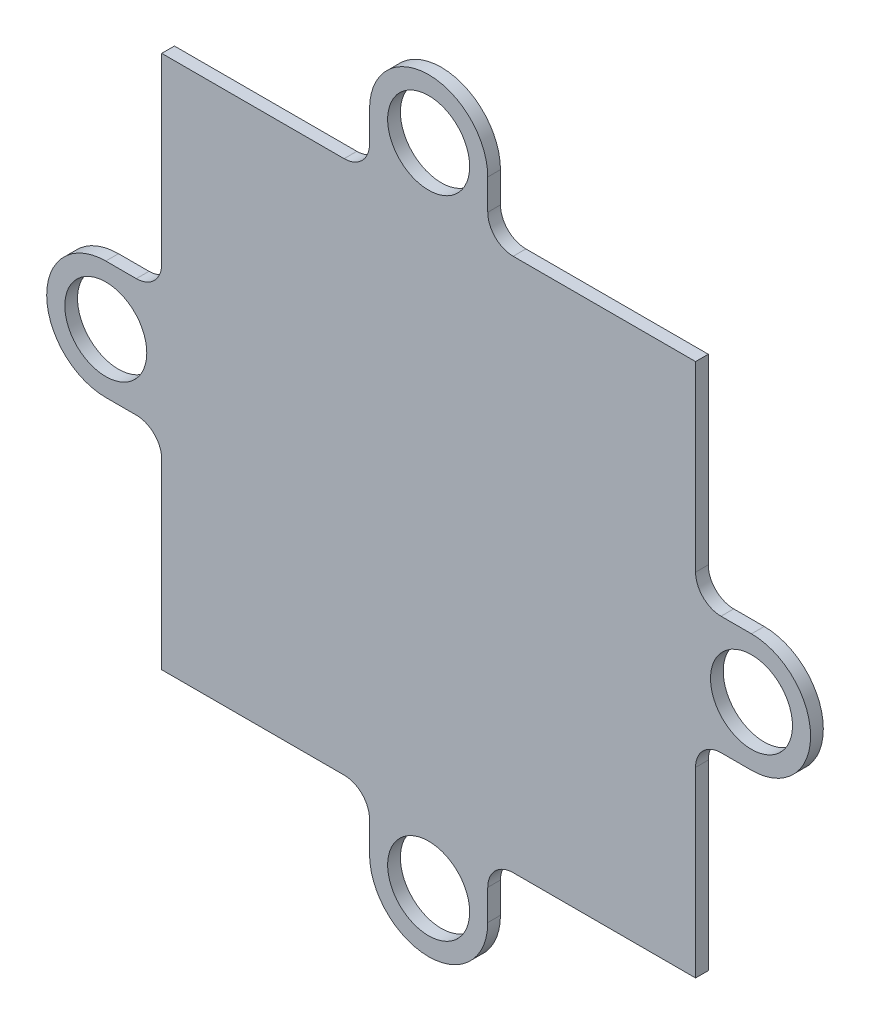
ISO-10303-21;
HEADER;
FILE_DESCRIPTION(('STEP AP214'),'2;1');
FILE_NAME('part.step','',(''),(''),'','','');
FILE_SCHEMA(('AUTOMOTIVE_DESIGN { 1 0 10303 214 1 1 1 1 }'));
ENDSEC;
DATA;
#1=APPLICATION_CONTEXT('core data for automotive mechanical design processes');
#2=APPLICATION_PROTOCOL_DEFINITION('international standard','automotive_design',2000,#1);
#3=PRODUCT_CONTEXT('',#1,'mechanical');
#4=PRODUCT('Part','Part','',(#3));
#5=PRODUCT_RELATED_PRODUCT_CATEGORY('part','',(#4));
#6=PRODUCT_DEFINITION_FORMATION('','',#4);
#7=PRODUCT_DEFINITION_CONTEXT('part definition',#1,'design');
#8=PRODUCT_DEFINITION('design','',#6,#7);
#9=PRODUCT_DEFINITION_SHAPE('','',#8);
#10=(LENGTH_UNIT() NAMED_UNIT(*) SI_UNIT(.MILLI.,.METRE.));
#11=(NAMED_UNIT(*) PLANE_ANGLE_UNIT() SI_UNIT($,.RADIAN.));
#12=(NAMED_UNIT(*) SI_UNIT($,.STERADIAN.) SOLID_ANGLE_UNIT());
#13=UNCERTAINTY_MEASURE_WITH_UNIT(LENGTH_MEASURE(1.E-05),#10,'distance_accuracy_value','');
#14=(GEOMETRIC_REPRESENTATION_CONTEXT(3) GLOBAL_UNCERTAINTY_ASSIGNED_CONTEXT((#13)) GLOBAL_UNIT_ASSIGNED_CONTEXT((#10,
#11,#12)) REPRESENTATION_CONTEXT('',''));
#15=CARTESIAN_POINT('',(0.,0.,0.));
#16=DIRECTION('',(0.,0.,1.));
#17=DIRECTION('',(1.,0.,0.));
#18=AXIS2_PLACEMENT_3D('',#15,#16,#17);
#19=CARTESIAN_POINT('',(0.,-4.64999999999974,1.));
#20=DIRECTION('',(0.,1.,0.));
#21=DIRECTION('',(0.,0.,1.));
#22=AXIS2_PLACEMENT_3D('',#19,#20,#21);
#23=PLANE('',#22);
#24=DIRECTION('',(1.,0.,0.));
#25=VECTOR('',#24,1.);
#26=CARTESIAN_POINT('',(0.,-4.64999999999974,0.));
#27=LINE('',#26,#25);
#28=CARTESIAN_POINT('',(-25.4000000000001,-4.64999999999974,0.));
#29=VERTEX_POINT('',#28);
#30=CARTESIAN_POINT('',(-23.0000000000001,-4.64999999999974,0.));
#31=VERTEX_POINT('',#30);
#32=EDGE_CURVE('E282',#29,#31,#27,.T.);
#33=ORIENTED_EDGE('',*,*,#32,.T.);
#34=DIRECTION('',(0.,0.,-1.));
#35=VECTOR('',#34,1.);
#36=CARTESIAN_POINT('',(-23.0000000000001,-4.64999999999974,1.));
#37=LINE('',#36,#35);
#38=CARTESIAN_POINT('',(-23.0000000000001,-4.64999999999974,1.));
#39=VERTEX_POINT('',#38);
#40=EDGE_CURVE('E11',#39,#31,#37,.T.);
#41=ORIENTED_EDGE('',*,*,#40,.F.);
#42=DIRECTION('',(1.,0.,0.));
#43=VECTOR('',#42,1.);
#44=CARTESIAN_POINT('',(0.,-4.64999999999974,1.));
#45=LINE('',#44,#43);
#46=CARTESIAN_POINT('',(-25.4000000000001,-4.64999999999974,1.));
#47=VERTEX_POINT('',#46);
#48=EDGE_CURVE('E488',#47,#39,#45,.T.);
#49=ORIENTED_EDGE('',*,*,#48,.F.);
#50=DIRECTION('',(0.,0.,-1.));
#51=VECTOR('',#50,1.);
#52=CARTESIAN_POINT('',(-25.4000000000001,-4.64999999999974,1.));
#53=LINE('',#52,#51);
#54=EDGE_CURVE('E262',#47,#29,#53,.T.);
#55=ORIENTED_EDGE('',*,*,#54,.T.);
#56=EDGE_LOOP('',(#33,#41,#49,#55));
#57=FACE_BOUND('',#56,.T.);
#58=ADVANCED_FACE('F45',(#57),#23,.F.);
#59=CARTESIAN_POINT('',(-23.0000000000001,-6.64999999999976,1.));
#60=DIRECTION('',(0.,0.,-1.));
#61=DIRECTION('',(-1.,0.,0.));
#62=AXIS2_PLACEMENT_3D('',#59,#60,#61);
#63=CYLINDRICAL_SURFACE('',#62,2.00000000000001);
#64=CARTESIAN_POINT('',(-23.0000000000001,-6.64999999999976,0.));
#65=DIRECTION('',(0.,0.,1.));
#66=DIRECTION('',(1.,0.,0.));
#67=AXIS2_PLACEMENT_3D('',#64,#65,#66);
#68=CIRCLE('',#67,2.00000000000001);
#69=CARTESIAN_POINT('',(-21.0000000000001,-6.6499999999998,0.));
#70=VERTEX_POINT('',#69);
#71=EDGE_CURVE('E286',#31,#70,#68,.F.);
#72=ORIENTED_EDGE('',*,*,#71,.T.);
#73=DIRECTION('',(0.,0.,-1.));
#74=VECTOR('',#73,1.);
#75=CARTESIAN_POINT('',(-21.0000000000001,-6.6499999999998,1.));
#76=LINE('',#75,#74);
#77=CARTESIAN_POINT('',(-21.0000000000001,-6.6499999999998,1.));
#78=VERTEX_POINT('',#77);
#79=EDGE_CURVE('E55',#78,#70,#76,.T.);
#80=ORIENTED_EDGE('',*,*,#79,.F.);
#81=CARTESIAN_POINT('',(-23.0000000000001,-6.64999999999976,1.));
#82=DIRECTION('',(0.,0.,1.));
#83=DIRECTION('',(1.,0.,0.));
#84=AXIS2_PLACEMENT_3D('',#81,#82,#83);
#85=CIRCLE('',#84,2.00000000000001);
#86=EDGE_CURVE('E162',#39,#78,#85,.F.);
#87=ORIENTED_EDGE('',*,*,#86,.F.);
#88=ORIENTED_EDGE('',*,*,#40,.T.);
#89=EDGE_LOOP('',(#72,#80,#87,#88));
#90=FACE_BOUND('',#89,.T.);
#91=ADVANCED_FACE('F468',(#90),#63,.F.);
#92=CARTESIAN_POINT('',(-21.0000000000001,-1.01544788837666E-13,1.));
#93=DIRECTION('',(-1.,0.,0.));
#94=DIRECTION('',(0.,-1.,0.));
#95=AXIS2_PLACEMENT_3D('',#92,#93,#94);
#96=PLANE('',#95);
#97=DIRECTION('',(0.,1.,0.));
#98=VECTOR('',#97,1.);
#99=CARTESIAN_POINT('',(-21.0000000000001,-1.01544788837666E-13,0.));
#100=LINE('',#99,#98);
#101=CARTESIAN_POINT('',(-21.,-21.,0.));
#102=VERTEX_POINT('',#101);
#103=EDGE_CURVE('E290',#102,#70,#100,.T.);
#104=ORIENTED_EDGE('',*,*,#103,.F.);
#105=DIRECTION('',(0.,0.,-1.));
#106=VECTOR('',#105,1.);
#107=CARTESIAN_POINT('',(-21.,-21.,1.));
#108=LINE('',#107,#106);
#109=CARTESIAN_POINT('',(-21.,-21.,1.));
#110=VERTEX_POINT('',#109);
#111=EDGE_CURVE('E459',#110,#102,#108,.T.);
#112=ORIENTED_EDGE('',*,*,#111,.F.);
#113=DIRECTION('',(0.,1.,0.));
#114=VECTOR('',#113,1.);
#115=CARTESIAN_POINT('',(-21.0000000000001,-1.01544788837666E-13,1.));
#116=LINE('',#115,#114);
#117=EDGE_CURVE('E467',#110,#78,#116,.T.);
#118=ORIENTED_EDGE('',*,*,#117,.T.);
#119=ORIENTED_EDGE('',*,*,#79,.T.);
#120=EDGE_LOOP('',(#104,#112,#118,#119));
#121=FACE_BOUND('',#120,.T.);
#122=ADVANCED_FACE('F465',(#121),#96,.T.);
#123=CARTESIAN_POINT('',(1.827806199078E-13,-20.9999999999998,1.));
#124=DIRECTION('',(0.,1.,0.));
#125=DIRECTION('',(-1.,0.,0.));
#126=AXIS2_PLACEMENT_3D('',#123,#124,#125);
#127=PLANE('',#126);
#128=DIRECTION('',(1.,0.,0.));
#129=VECTOR('',#128,1.);
#130=CARTESIAN_POINT('',(1.827806199078E-13,-20.9999999999998,0.));
#131=LINE('',#130,#129);
#132=CARTESIAN_POINT('',(-6.65000000000012,-20.9999999999999,0.));
#133=VERTEX_POINT('',#132);
#134=EDGE_CURVE('E294',#102,#133,#131,.T.);
#135=ORIENTED_EDGE('',*,*,#134,.T.);
#136=DIRECTION('',(0.,0.,-1.));
#137=VECTOR('',#136,1.);
#138=CARTESIAN_POINT('',(-6.65000000000012,-20.9999999999999,1.));
#139=LINE('',#138,#137);
#140=CARTESIAN_POINT('',(-6.65000000000012,-20.9999999999999,1.));
#141=VERTEX_POINT('',#140);
#142=EDGE_CURVE('E456',#141,#133,#139,.T.);
#143=ORIENTED_EDGE('',*,*,#142,.F.);
#144=DIRECTION('',(1.,0.,0.));
#145=VECTOR('',#144,1.);
#146=CARTESIAN_POINT('',(1.827806199078E-13,-20.9999999999998,1.));
#147=LINE('',#146,#145);
#148=EDGE_CURVE('E480',#110,#141,#147,.T.);
#149=ORIENTED_EDGE('',*,*,#148,.F.);
#150=ORIENTED_EDGE('',*,*,#111,.T.);
#151=EDGE_LOOP('',(#135,#143,#149,#150));
#152=FACE_BOUND('',#151,.T.);
#153=ADVANCED_FACE('F477',(#152),#127,.F.);
#154=CARTESIAN_POINT('',(-6.65000000000008,-22.9999999999999,1.));
#155=DIRECTION('',(0.,0.,-1.));
#156=DIRECTION('',(-1.,0.,0.));
#157=AXIS2_PLACEMENT_3D('',#154,#155,#156);
#158=CYLINDRICAL_SURFACE('',#157,2.);
#159=CARTESIAN_POINT('',(-6.65000000000008,-22.9999999999999,0.));
#160=DIRECTION('',(0.,0.,1.));
#161=DIRECTION('',(1.,0.,0.));
#162=AXIS2_PLACEMENT_3D('',#159,#160,#161);
#163=CIRCLE('',#162,2.);
#164=CARTESIAN_POINT('',(-4.65000000000009,-22.9999999999999,0.));
#165=VERTEX_POINT('',#164);
#166=EDGE_CURVE('E298',#165,#133,#163,.T.);
#167=ORIENTED_EDGE('',*,*,#166,.F.);
#168=DIRECTION('',(0.,0.,-1.));
#169=VECTOR('',#168,1.);
#170=CARTESIAN_POINT('',(-4.65000000000009,-22.9999999999999,1.));
#171=LINE('',#170,#169);
#172=CARTESIAN_POINT('',(-4.65000000000009,-22.9999999999999,1.));
#173=VERTEX_POINT('',#172);
#174=EDGE_CURVE('E453',#173,#165,#171,.T.);
#175=ORIENTED_EDGE('',*,*,#174,.F.);
#176=CARTESIAN_POINT('',(-6.65000000000008,-22.9999999999999,1.));
#177=DIRECTION('',(0.,0.,1.));
#178=DIRECTION('',(1.,0.,0.));
#179=AXIS2_PLACEMENT_3D('',#176,#177,#178);
#180=CIRCLE('',#179,2.);
#181=EDGE_CURVE('E483',#173,#141,#180,.T.);
#182=ORIENTED_EDGE('',*,*,#181,.T.);
#183=ORIENTED_EDGE('',*,*,#142,.T.);
#184=EDGE_LOOP('',(#167,#175,#182,#183));
#185=FACE_BOUND('',#184,.T.);
#186=ADVANCED_FACE('F841',(#185),#158,.F.);
#187=CARTESIAN_POINT('',(-4.65000000000009,0.,1.));
#188=DIRECTION('',(-1.,0.,0.));
#189=DIRECTION('',(0.,0.,1.));
#190=AXIS2_PLACEMENT_3D('',#187,#188,#189);
#191=PLANE('',#190);
#192=DIRECTION('',(0.,1.,0.));
#193=VECTOR('',#192,1.);
#194=CARTESIAN_POINT('',(-4.65000000000009,0.,0.));
#195=LINE('',#194,#193);
#196=CARTESIAN_POINT('',(-4.65000000000009,-25.4,0.));
#197=VERTEX_POINT('',#196);
#198=EDGE_CURVE('E302',#197,#165,#195,.T.);
#199=ORIENTED_EDGE('',*,*,#198,.F.);
#200=DIRECTION('',(0.,0.,-1.));
#201=VECTOR('',#200,1.);
#202=CARTESIAN_POINT('',(-4.65000000000009,-25.4,1.));
#203=LINE('',#202,#201);
#204=CARTESIAN_POINT('',(-4.65000000000009,-25.4,1.));
#205=VERTEX_POINT('',#204);
#206=EDGE_CURVE('E450',#205,#197,#203,.T.);
#207=ORIENTED_EDGE('',*,*,#206,.F.);
#208=DIRECTION('',(0.,1.,0.));
#209=VECTOR('',#208,1.);
#210=CARTESIAN_POINT('',(-4.65000000000009,0.,1.));
#211=LINE('',#210,#209);
#212=EDGE_CURVE('E494',#205,#173,#211,.T.);
#213=ORIENTED_EDGE('',*,*,#212,.T.);
#214=ORIENTED_EDGE('',*,*,#174,.T.);
#215=EDGE_LOOP('',(#199,#207,#213,#214));
#216=FACE_BOUND('',#215,.T.);
#217=ADVANCED_FACE('F832',(#216),#191,.T.);
#218=CARTESIAN_POINT('',(0.,-25.4,1.));
#219=DIRECTION('',(0.,0.,-1.));
#220=DIRECTION('',(-1.,0.,0.));
#221=AXIS2_PLACEMENT_3D('',#218,#219,#220);
#222=CYLINDRICAL_SURFACE('',#221,4.65);
#223=CARTESIAN_POINT('',(0.,-25.4,0.));
#224=DIRECTION('',(0.,0.,1.));
#225=DIRECTION('',(1.,0.,0.));
#226=AXIS2_PLACEMENT_3D('',#223,#224,#225);
#227=CIRCLE('',#226,4.65);
#228=CARTESIAN_POINT('',(4.64999999999991,-25.4,0.));
#229=VERTEX_POINT('',#228);
#230=EDGE_CURVE('E306',#197,#229,#227,.T.);
#231=ORIENTED_EDGE('',*,*,#230,.T.);
#232=DIRECTION('',(0.,0.,-1.));
#233=VECTOR('',#232,1.);
#234=CARTESIAN_POINT('',(4.64999999999991,-25.4,1.));
#235=LINE('',#234,#233);
#236=CARTESIAN_POINT('',(4.64999999999991,-25.4,1.));
#237=VERTEX_POINT('',#236);
#238=EDGE_CURVE('E446',#237,#229,#235,.T.);
#239=ORIENTED_EDGE('',*,*,#238,.F.);
#240=CARTESIAN_POINT('',(0.,-25.4,1.));
#241=DIRECTION('',(0.,0.,1.));
#242=DIRECTION('',(1.,0.,0.));
#243=AXIS2_PLACEMENT_3D('',#240,#241,#242);
#244=CIRCLE('',#243,4.65);
#245=EDGE_CURVE('E498',#205,#237,#244,.T.);
#246=ORIENTED_EDGE('',*,*,#245,.F.);
#247=ORIENTED_EDGE('',*,*,#206,.T.);
#248=EDGE_LOOP('',(#231,#239,#246,#247));
#249=FACE_BOUND('',#248,.T.);
#250=ADVANCED_FACE('F823',(#249),#222,.T.);
#251=CARTESIAN_POINT('',(4.64999999999991,0.,1.));
#252=DIRECTION('',(-1.,0.,0.));
#253=DIRECTION('',(0.,0.,1.));
#254=AXIS2_PLACEMENT_3D('',#251,#252,#253);
#255=PLANE('',#254);
#256=DIRECTION('',(0.,1.,0.));
#257=VECTOR('',#256,1.);
#258=CARTESIAN_POINT('',(4.64999999999991,0.,0.));
#259=LINE('',#258,#257);
#260=CARTESIAN_POINT('',(4.64999999999991,-22.9999999999999,0.));
#261=VERTEX_POINT('',#260);
#262=EDGE_CURVE('E309',#229,#261,#259,.T.);
#263=ORIENTED_EDGE('',*,*,#262,.T.);
#264=DIRECTION('',(0.,0.,-1.));
#265=VECTOR('',#264,1.);
#266=CARTESIAN_POINT('',(4.64999999999991,-22.9999999999999,1.));
#267=LINE('',#266,#265);
#268=CARTESIAN_POINT('',(4.64999999999991,-22.9999999999999,1.));
#269=VERTEX_POINT('',#268);
#270=EDGE_CURVE('E442',#269,#261,#267,.T.);
#271=ORIENTED_EDGE('',*,*,#270,.F.);
#272=DIRECTION('',(0.,1.,0.));
#273=VECTOR('',#272,1.);
#274=CARTESIAN_POINT('',(4.64999999999991,0.,1.));
#275=LINE('',#274,#273);
#276=EDGE_CURVE('E501',#237,#269,#275,.T.);
#277=ORIENTED_EDGE('',*,*,#276,.F.);
#278=ORIENTED_EDGE('',*,*,#238,.T.);
#279=EDGE_LOOP('',(#263,#271,#277,#278));
#280=FACE_BOUND('',#279,.T.);
#281=ADVANCED_FACE('F814',(#280),#255,.F.);
#282=CARTESIAN_POINT('',(6.6499999999999,-22.9999999999999,1.));
#283=DIRECTION('',(0.,0.,-1.));
#284=DIRECTION('',(-1.,0.,0.));
#285=AXIS2_PLACEMENT_3D('',#282,#283,#284);
#286=CYLINDRICAL_SURFACE('',#285,2.);
#287=CARTESIAN_POINT('',(6.6499999999999,-22.9999999999999,0.));
#288=DIRECTION('',(0.,0.,1.));
#289=DIRECTION('',(1.,0.,0.));
#290=AXIS2_PLACEMENT_3D('',#287,#288,#289);
#291=CIRCLE('',#290,2.);
#292=CARTESIAN_POINT('',(6.64999999999994,-20.9999999999999,0.));
#293=VERTEX_POINT('',#292);
#294=EDGE_CURVE('E312',#261,#293,#291,.F.);
#295=ORIENTED_EDGE('',*,*,#294,.T.);
#296=DIRECTION('',(0.,0.,-1.));
#297=VECTOR('',#296,1.);
#298=CARTESIAN_POINT('',(6.64999999999994,-20.9999999999999,1.));
#299=LINE('',#298,#297);
#300=CARTESIAN_POINT('',(6.64999999999994,-20.9999999999999,1.));
#301=VERTEX_POINT('',#300);
#302=EDGE_CURVE('E438',#301,#293,#299,.T.);
#303=ORIENTED_EDGE('',*,*,#302,.F.);
#304=CARTESIAN_POINT('',(6.6499999999999,-22.9999999999999,1.));
#305=DIRECTION('',(0.,0.,1.));
#306=DIRECTION('',(1.,0.,0.));
#307=AXIS2_PLACEMENT_3D('',#304,#305,#306);
#308=CIRCLE('',#307,2.);
#309=EDGE_CURVE('E504',#269,#301,#308,.F.);
#310=ORIENTED_EDGE('',*,*,#309,.F.);
#311=ORIENTED_EDGE('',*,*,#270,.T.);
#312=EDGE_LOOP('',(#295,#303,#310,#311));
#313=FACE_BOUND('',#312,.T.);
#314=ADVANCED_FACE('F805',(#313),#286,.F.);
#315=CARTESIAN_POINT('',(0.,-20.9999999999999,1.));
#316=DIRECTION('',(0.,1.,0.));
#317=DIRECTION('',(0.,0.,1.));
#318=AXIS2_PLACEMENT_3D('',#315,#316,#317);
#319=PLANE('',#318);
#320=DIRECTION('',(1.,0.,0.));
#321=VECTOR('',#320,1.);
#322=CARTESIAN_POINT('',(0.,-20.9999999999999,0.));
#323=LINE('',#322,#321);
#324=CARTESIAN_POINT('',(21.,-21.,0.));
#325=VERTEX_POINT('',#324);
#326=EDGE_CURVE('E315',#293,#325,#323,.T.);
#327=ORIENTED_EDGE('',*,*,#326,.T.);
#328=DIRECTION('',(0.,0.,-1.));
#329=VECTOR('',#328,1.);
#330=CARTESIAN_POINT('',(21.,-21.,1.));
#331=LINE('',#330,#329);
#332=CARTESIAN_POINT('',(21.,-21.,1.));
#333=VERTEX_POINT('',#332);
#334=EDGE_CURVE('E434',#333,#325,#331,.T.);
#335=ORIENTED_EDGE('',*,*,#334,.F.);
#336=DIRECTION('',(1.,0.,0.));
#337=VECTOR('',#336,1.);
#338=CARTESIAN_POINT('',(0.,-20.9999999999999,1.));
#339=LINE('',#338,#337);
#340=EDGE_CURVE('E507',#301,#333,#339,.T.);
#341=ORIENTED_EDGE('',*,*,#340,.F.);
#342=ORIENTED_EDGE('',*,*,#302,.T.);
#343=EDGE_LOOP('',(#327,#335,#341,#342));
#344=FACE_BOUND('',#343,.T.);
#345=ADVANCED_FACE('F796',(#344),#319,.F.);
#346=CARTESIAN_POINT('',(21.,0.,1.));
#347=DIRECTION('',(-1.,0.,0.));
#348=DIRECTION('',(0.,-1.,0.));
#349=AXIS2_PLACEMENT_3D('',#346,#347,#348);
#350=PLANE('',#349);
#351=DIRECTION('',(0.,1.,0.));
#352=VECTOR('',#351,1.);
#353=CARTESIAN_POINT('',(21.,0.,0.));
#354=LINE('',#353,#352);
#355=CARTESIAN_POINT('',(21.,-6.6500000000001,0.));
#356=VERTEX_POINT('',#355);
#357=EDGE_CURVE('E318',#325,#356,#354,.T.);
#358=ORIENTED_EDGE('',*,*,#357,.T.);
#359=DIRECTION('',(0.,0.,-1.));
#360=VECTOR('',#359,1.);
#361=CARTESIAN_POINT('',(21.,-6.6500000000001,1.));
#362=LINE('',#361,#360);
#363=CARTESIAN_POINT('',(21.,-6.6500000000001,1.));
#364=VERTEX_POINT('',#363);
#365=EDGE_CURVE('E431',#364,#356,#362,.T.);
#366=ORIENTED_EDGE('',*,*,#365,.F.);
#367=DIRECTION('',(0.,1.,0.));
#368=VECTOR('',#367,1.);
#369=CARTESIAN_POINT('',(21.,0.,1.));
#370=LINE('',#369,#368);
#371=EDGE_CURVE('E510',#333,#364,#370,.T.);
#372=ORIENTED_EDGE('',*,*,#371,.F.);
#373=ORIENTED_EDGE('',*,*,#334,.T.);
#374=EDGE_LOOP('',(#358,#366,#372,#373));
#375=FACE_BOUND('',#374,.T.);
#376=ADVANCED_FACE('F787',(#375),#350,.F.);
#377=CARTESIAN_POINT('',(23.,-6.65000000000009,1.));
#378=DIRECTION('',(0.,0.,-1.));
#379=DIRECTION('',(-1.,0.,0.));
#380=AXIS2_PLACEMENT_3D('',#377,#378,#379);
#381=CYLINDRICAL_SURFACE('',#380,2.);
#382=CARTESIAN_POINT('',(23.,-6.65000000000009,0.));
#383=DIRECTION('',(0.,0.,1.));
#384=DIRECTION('',(1.,0.,0.));
#385=AXIS2_PLACEMENT_3D('',#382,#383,#384);
#386=CIRCLE('',#385,2.);
#387=CARTESIAN_POINT('',(23.,-4.6500000000001,0.));
#388=VERTEX_POINT('',#387);
#389=EDGE_CURVE('E322',#388,#356,#386,.T.);
#390=ORIENTED_EDGE('',*,*,#389,.F.);
#391=DIRECTION('',(0.,0.,-1.));
#392=VECTOR('',#391,1.);
#393=CARTESIAN_POINT('',(23.,-4.6500000000001,1.));
#394=LINE('',#393,#392);
#395=CARTESIAN_POINT('',(23.,-4.6500000000001,1.));
#396=VERTEX_POINT('',#395);
#397=EDGE_CURVE('E428',#396,#388,#394,.T.);
#398=ORIENTED_EDGE('',*,*,#397,.F.);
#399=CARTESIAN_POINT('',(23.,-6.65000000000009,1.));
#400=DIRECTION('',(0.,0.,1.));
#401=DIRECTION('',(1.,0.,0.));
#402=AXIS2_PLACEMENT_3D('',#399,#400,#401);
#403=CIRCLE('',#402,2.);
#404=EDGE_CURVE('E513',#396,#364,#403,.T.);
#405=ORIENTED_EDGE('',*,*,#404,.T.);
#406=ORIENTED_EDGE('',*,*,#365,.T.);
#407=EDGE_LOOP('',(#390,#398,#405,#406));
#408=FACE_BOUND('',#407,.T.);
#409=ADVANCED_FACE('F778',(#408),#381,.F.);
#410=CARTESIAN_POINT('',(0.,-4.6500000000001,1.));
#411=DIRECTION('',(0.,-1.,0.));
#412=DIRECTION('',(0.,0.,-1.));
#413=AXIS2_PLACEMENT_3D('',#410,#411,#412);
#414=PLANE('',#413);
#415=DIRECTION('',(-1.,0.,0.));
#416=VECTOR('',#415,1.);
#417=CARTESIAN_POINT('',(0.,-4.6500000000001,0.));
#418=LINE('',#417,#416);
#419=CARTESIAN_POINT('',(25.4000000000001,-4.6500000000001,0.));
#420=VERTEX_POINT('',#419);
#421=EDGE_CURVE('E326',#420,#388,#418,.T.);
#422=ORIENTED_EDGE('',*,*,#421,.F.);
#423=DIRECTION('',(0.,0.,-1.));
#424=VECTOR('',#423,1.);
#425=CARTESIAN_POINT('',(25.4000000000001,-4.6500000000001,1.));
#426=LINE('',#425,#424);
#427=CARTESIAN_POINT('',(25.4000000000001,-4.6500000000001,1.));
#428=VERTEX_POINT('',#427);
#429=EDGE_CURVE('E425',#428,#420,#426,.T.);
#430=ORIENTED_EDGE('',*,*,#429,.F.);
#431=DIRECTION('',(-1.,0.,0.));
#432=VECTOR('',#431,1.);
#433=CARTESIAN_POINT('',(0.,-4.6500000000001,1.));
#434=LINE('',#433,#432);
#435=EDGE_CURVE('E517',#428,#396,#434,.T.);
#436=ORIENTED_EDGE('',*,*,#435,.T.);
#437=ORIENTED_EDGE('',*,*,#397,.T.);
#438=EDGE_LOOP('',(#422,#430,#436,#437));
#439=FACE_BOUND('',#438,.T.);
#440=ADVANCED_FACE('F769',(#439),#414,.T.);
#441=CARTESIAN_POINT('',(25.4000000000001,0.,1.));
#442=DIRECTION('',(0.,0.,-1.));
#443=DIRECTION('',(-1.,0.,0.));
#444=AXIS2_PLACEMENT_3D('',#441,#442,#443);
#445=CYLINDRICAL_SURFACE('',#444,4.65);
#446=CARTESIAN_POINT('',(25.4000000000001,0.,0.));
#447=DIRECTION('',(0.,0.,1.));
#448=DIRECTION('',(1.,0.,0.));
#449=AXIS2_PLACEMENT_3D('',#446,#447,#448);
#450=CIRCLE('',#449,4.65);
#451=CARTESIAN_POINT('',(25.4000000000001,4.6499999999999,0.));
#452=VERTEX_POINT('',#451);
#453=EDGE_CURVE('E330',#420,#452,#450,.T.);
#454=ORIENTED_EDGE('',*,*,#453,.T.);
#455=DIRECTION('',(0.,0.,-1.));
#456=VECTOR('',#455,1.);
#457=CARTESIAN_POINT('',(25.4000000000001,4.6499999999999,1.));
#458=LINE('',#457,#456);
#459=CARTESIAN_POINT('',(25.4000000000001,4.6499999999999,1.));
#460=VERTEX_POINT('',#459);
#461=EDGE_CURVE('E421',#460,#452,#458,.T.);
#462=ORIENTED_EDGE('',*,*,#461,.F.);
#463=CARTESIAN_POINT('',(25.4000000000001,0.,1.));
#464=DIRECTION('',(0.,0.,1.));
#465=DIRECTION('',(1.,0.,0.));
#466=AXIS2_PLACEMENT_3D('',#463,#464,#465);
#467=CIRCLE('',#466,4.65);
#468=EDGE_CURVE('E521',#428,#460,#467,.T.);
#469=ORIENTED_EDGE('',*,*,#468,.F.);
#470=ORIENTED_EDGE('',*,*,#429,.T.);
#471=EDGE_LOOP('',(#454,#462,#469,#470));
#472=FACE_BOUND('',#471,.T.);
#473=ADVANCED_FACE('F760',(#472),#445,.T.);
#474=CARTESIAN_POINT('',(0.,4.6499999999999,1.));
#475=DIRECTION('',(0.,-1.,0.));
#476=DIRECTION('',(0.,0.,-1.));
#477=AXIS2_PLACEMENT_3D('',#474,#475,#476);
#478=PLANE('',#477);
#479=DIRECTION('',(-1.,0.,0.));
#480=VECTOR('',#479,1.);
#481=CARTESIAN_POINT('',(0.,4.6499999999999,0.));
#482=LINE('',#481,#480);
#483=CARTESIAN_POINT('',(23.,4.6499999999999,0.));
#484=VERTEX_POINT('',#483);
#485=EDGE_CURVE('E333',#452,#484,#482,.T.);
#486=ORIENTED_EDGE('',*,*,#485,.T.);
#487=DIRECTION('',(0.,0.,-1.));
#488=VECTOR('',#487,1.);
#489=CARTESIAN_POINT('',(23.,4.6499999999999,1.));
#490=LINE('',#489,#488);
#491=CARTESIAN_POINT('',(23.,4.6499999999999,1.));
#492=VERTEX_POINT('',#491);
#493=EDGE_CURVE('E417',#492,#484,#490,.T.);
#494=ORIENTED_EDGE('',*,*,#493,.F.);
#495=DIRECTION('',(-1.,0.,0.));
#496=VECTOR('',#495,1.);
#497=CARTESIAN_POINT('',(0.,4.6499999999999,1.));
#498=LINE('',#497,#496);
#499=EDGE_CURVE('E524',#460,#492,#498,.T.);
#500=ORIENTED_EDGE('',*,*,#499,.F.);
#501=ORIENTED_EDGE('',*,*,#461,.T.);
#502=EDGE_LOOP('',(#486,#494,#500,#501));
#503=FACE_BOUND('',#502,.T.);
#504=ADVANCED_FACE('F751',(#503),#478,.F.);
#505=CARTESIAN_POINT('',(23.,6.64999999999991,1.));
#506=DIRECTION('',(0.,0.,-1.));
#507=DIRECTION('',(-1.,0.,0.));
#508=AXIS2_PLACEMENT_3D('',#505,#506,#507);
#509=CYLINDRICAL_SURFACE('',#508,2.00000000000001);
#510=CARTESIAN_POINT('',(23.,6.64999999999991,0.));
#511=DIRECTION('',(0.,0.,1.));
#512=DIRECTION('',(1.,0.,0.));
#513=AXIS2_PLACEMENT_3D('',#510,#511,#512);
#514=CIRCLE('',#513,2.00000000000001);
#515=CARTESIAN_POINT('',(21.,6.64999999999993,0.));
#516=VERTEX_POINT('',#515);
#517=EDGE_CURVE('E336',#484,#516,#514,.F.);
#518=ORIENTED_EDGE('',*,*,#517,.T.);
#519=DIRECTION('',(0.,0.,-1.));
#520=VECTOR('',#519,1.);
#521=CARTESIAN_POINT('',(21.,6.64999999999993,1.));
#522=LINE('',#521,#520);
#523=CARTESIAN_POINT('',(21.,6.64999999999993,1.));
#524=VERTEX_POINT('',#523);
#525=EDGE_CURVE('E413',#524,#516,#522,.T.);
#526=ORIENTED_EDGE('',*,*,#525,.F.);
#527=CARTESIAN_POINT('',(23.,6.64999999999991,1.));
#528=DIRECTION('',(0.,0.,1.));
#529=DIRECTION('',(1.,0.,0.));
#530=AXIS2_PLACEMENT_3D('',#527,#528,#529);
#531=CIRCLE('',#530,2.00000000000001);
#532=EDGE_CURVE('E527',#492,#524,#531,.F.);
#533=ORIENTED_EDGE('',*,*,#532,.F.);
#534=ORIENTED_EDGE('',*,*,#493,.T.);
#535=EDGE_LOOP('',(#518,#526,#533,#534));
#536=FACE_BOUND('',#535,.T.);
#537=ADVANCED_FACE('F742',(#536),#509,.F.);
#538=CARTESIAN_POINT('',(21.,0.,1.));
#539=DIRECTION('',(-1.,0.,0.));
#540=DIRECTION('',(0.,0.,1.));
#541=AXIS2_PLACEMENT_3D('',#538,#539,#540);
#542=PLANE('',#541);
#543=DIRECTION('',(0.,1.,0.));
#544=VECTOR('',#543,1.);
#545=CARTESIAN_POINT('',(21.,0.,0.));
#546=LINE('',#545,#544);
#547=CARTESIAN_POINT('',(21.,21.,0.));
#548=VERTEX_POINT('',#547);
#549=EDGE_CURVE('E339',#516,#548,#546,.T.);
#550=ORIENTED_EDGE('',*,*,#549,.T.);
#551=DIRECTION('',(0.,0.,-1.));
#552=VECTOR('',#551,1.);
#553=CARTESIAN_POINT('',(21.,21.,1.));
#554=LINE('',#553,#552);
#555=CARTESIAN_POINT('',(21.,21.,1.));
#556=VERTEX_POINT('',#555);
#557=EDGE_CURVE('E410',#556,#548,#554,.T.);
#558=ORIENTED_EDGE('',*,*,#557,.F.);
#559=DIRECTION('',(0.,1.,0.));
#560=VECTOR('',#559,1.);
#561=CARTESIAN_POINT('',(21.,0.,1.));
#562=LINE('',#561,#560);
#563=EDGE_CURVE('E530',#524,#556,#562,.T.);
#564=ORIENTED_EDGE('',*,*,#563,.F.);
#565=ORIENTED_EDGE('',*,*,#525,.T.);
#566=EDGE_LOOP('',(#550,#558,#564,#565));
#567=FACE_BOUND('',#566,.T.);
#568=ADVANCED_FACE('F733',(#567),#542,.F.);
#569=CARTESIAN_POINT('',(0.,21.,1.));
#570=DIRECTION('',(0.,1.,0.));
#571=DIRECTION('',(0.,0.,1.));
#572=AXIS2_PLACEMENT_3D('',#569,#570,#571);
#573=PLANE('',#572);
#574=DIRECTION('',(1.,0.,0.));
#575=VECTOR('',#574,1.);
#576=CARTESIAN_POINT('',(0.,21.,0.));
#577=LINE('',#576,#575);
#578=CARTESIAN_POINT('',(6.65000000000001,21.,0.));
#579=VERTEX_POINT('',#578);
#580=EDGE_CURVE('E343',#579,#548,#577,.T.);
#581=ORIENTED_EDGE('',*,*,#580,.F.);
#582=DIRECTION('',(0.,0.,-1.));
#583=VECTOR('',#582,1.);
#584=CARTESIAN_POINT('',(6.65000000000001,21.,1.));
#585=LINE('',#584,#583);
#586=CARTESIAN_POINT('',(6.65000000000001,21.,1.));
#587=VERTEX_POINT('',#586);
#588=EDGE_CURVE('E407',#587,#579,#585,.T.);
#589=ORIENTED_EDGE('',*,*,#588,.F.);
#590=DIRECTION('',(1.,0.,0.));
#591=VECTOR('',#590,1.);
#592=CARTESIAN_POINT('',(0.,21.,1.));
#593=LINE('',#592,#591);
#594=EDGE_CURVE('E533',#587,#556,#593,.T.);
#595=ORIENTED_EDGE('',*,*,#594,.T.);
#596=ORIENTED_EDGE('',*,*,#557,.T.);
#597=EDGE_LOOP('',(#581,#589,#595,#596));
#598=FACE_BOUND('',#597,.T.);
#599=ADVANCED_FACE('F724',(#598),#573,.T.);
#600=CARTESIAN_POINT('',(6.65000000000001,23.,1.));
#601=DIRECTION('',(0.,0.,-1.));
#602=DIRECTION('',(-1.,0.,0.));
#603=AXIS2_PLACEMENT_3D('',#600,#601,#602);
#604=CYLINDRICAL_SURFACE('',#603,2.);
#605=CARTESIAN_POINT('',(6.65000000000001,23.,0.));
#606=DIRECTION('',(0.,0.,1.));
#607=DIRECTION('',(1.,0.,0.));
#608=AXIS2_PLACEMENT_3D('',#605,#606,#607);
#609=CIRCLE('',#608,2.);
#610=CARTESIAN_POINT('',(4.65,23.,0.));
#611=VERTEX_POINT('',#610);
#612=EDGE_CURVE('E347',#611,#579,#609,.T.);
#613=ORIENTED_EDGE('',*,*,#612,.F.);
#614=DIRECTION('',(0.,0.,-1.));
#615=VECTOR('',#614,1.);
#616=CARTESIAN_POINT('',(4.65,23.,1.));
#617=LINE('',#616,#615);
#618=CARTESIAN_POINT('',(4.65,23.,1.));
#619=VERTEX_POINT('',#618);
#620=EDGE_CURVE('E404',#619,#611,#617,.T.);
#621=ORIENTED_EDGE('',*,*,#620,.F.);
#622=CARTESIAN_POINT('',(6.65000000000001,23.,1.));
#623=DIRECTION('',(0.,0.,1.));
#624=DIRECTION('',(1.,0.,0.));
#625=AXIS2_PLACEMENT_3D('',#622,#623,#624);
#626=CIRCLE('',#625,2.);
#627=EDGE_CURVE('E537',#619,#587,#626,.T.);
#628=ORIENTED_EDGE('',*,*,#627,.T.);
#629=ORIENTED_EDGE('',*,*,#588,.T.);
#630=EDGE_LOOP('',(#613,#621,#628,#629));
#631=FACE_BOUND('',#630,.T.);
#632=ADVANCED_FACE('F715',(#631),#604,.F.);
#633=CARTESIAN_POINT('',(4.65,0.,1.));
#634=DIRECTION('',(1.,0.,0.));
#635=DIRECTION('',(0.,0.,-1.));
#636=AXIS2_PLACEMENT_3D('',#633,#634,#635);
#637=PLANE('',#636);
#638=DIRECTION('',(0.,-1.,0.));
#639=VECTOR('',#638,1.);
#640=CARTESIAN_POINT('',(4.65,0.,0.));
#641=LINE('',#640,#639);
#642=CARTESIAN_POINT('',(4.65,25.4000000000001,0.));
#643=VERTEX_POINT('',#642);
#644=EDGE_CURVE('E351',#643,#611,#641,.T.);
#645=ORIENTED_EDGE('',*,*,#644,.F.);
#646=DIRECTION('',(0.,0.,-1.));
#647=VECTOR('',#646,1.);
#648=CARTESIAN_POINT('',(4.65,25.4000000000001,1.));
#649=LINE('',#648,#647);
#650=CARTESIAN_POINT('',(4.65,25.4000000000001,1.));
#651=VERTEX_POINT('',#650);
#652=EDGE_CURVE('E401',#651,#643,#649,.T.);
#653=ORIENTED_EDGE('',*,*,#652,.F.);
#654=DIRECTION('',(0.,-1.,0.));
#655=VECTOR('',#654,1.);
#656=CARTESIAN_POINT('',(4.65,0.,1.));
#657=LINE('',#656,#655);
#658=EDGE_CURVE('E541',#651,#619,#657,.T.);
#659=ORIENTED_EDGE('',*,*,#658,.T.);
#660=ORIENTED_EDGE('',*,*,#620,.T.);
#661=EDGE_LOOP('',(#645,#653,#659,#660));
#662=FACE_BOUND('',#661,.T.);
#663=ADVANCED_FACE('F706',(#662),#637,.T.);
#664=CARTESIAN_POINT('',(0.,25.4000000000001,1.));
#665=DIRECTION('',(0.,0.,-1.));
#666=DIRECTION('',(-1.,0.,0.));
#667=AXIS2_PLACEMENT_3D('',#664,#665,#666);
#668=CYLINDRICAL_SURFACE('',#667,4.65);
#669=CARTESIAN_POINT('',(0.,25.4000000000001,0.));
#670=DIRECTION('',(0.,0.,1.));
#671=DIRECTION('',(1.,0.,0.));
#672=AXIS2_PLACEMENT_3D('',#669,#670,#671);
#673=CIRCLE('',#672,4.65);
#674=CARTESIAN_POINT('',(-4.65,25.4000000000001,0.));
#675=VERTEX_POINT('',#674);
#676=EDGE_CURVE('E355',#643,#675,#673,.T.);
#677=ORIENTED_EDGE('',*,*,#676,.T.);
#678=DIRECTION('',(0.,0.,-1.));
#679=VECTOR('',#678,1.);
#680=CARTESIAN_POINT('',(-4.65,25.4000000000001,1.));
#681=LINE('',#680,#679);
#682=CARTESIAN_POINT('',(-4.65,25.4000000000001,1.));
#683=VERTEX_POINT('',#682);
#684=EDGE_CURVE('E397',#683,#675,#681,.T.);
#685=ORIENTED_EDGE('',*,*,#684,.F.);
#686=CARTESIAN_POINT('',(0.,25.4000000000001,1.));
#687=DIRECTION('',(0.,0.,1.));
#688=DIRECTION('',(1.,0.,0.));
#689=AXIS2_PLACEMENT_3D('',#686,#687,#688);
#690=CIRCLE('',#689,4.65);
#691=EDGE_CURVE('E545',#651,#683,#690,.T.);
#692=ORIENTED_EDGE('',*,*,#691,.F.);
#693=ORIENTED_EDGE('',*,*,#652,.T.);
#694=EDGE_LOOP('',(#677,#685,#692,#693));
#695=FACE_BOUND('',#694,.T.);
#696=ADVANCED_FACE('F697',(#695),#668,.T.);
#697=CARTESIAN_POINT('',(-4.65,0.,1.));
#698=DIRECTION('',(1.,0.,0.));
#699=DIRECTION('',(0.,0.,-1.));
#700=AXIS2_PLACEMENT_3D('',#697,#698,#699);
#701=PLANE('',#700);
#702=DIRECTION('',(0.,-1.,0.));
#703=VECTOR('',#702,1.);
#704=CARTESIAN_POINT('',(-4.65,0.,0.));
#705=LINE('',#704,#703);
#706=CARTESIAN_POINT('',(-4.65,23.,0.));
#707=VERTEX_POINT('',#706);
#708=EDGE_CURVE('E358',#675,#707,#705,.T.);
#709=ORIENTED_EDGE('',*,*,#708,.T.);
#710=DIRECTION('',(0.,0.,-1.));
#711=VECTOR('',#710,1.);
#712=CARTESIAN_POINT('',(-4.65,23.,1.));
#713=LINE('',#712,#711);
#714=CARTESIAN_POINT('',(-4.65,23.,1.));
#715=VERTEX_POINT('',#714);
#716=EDGE_CURVE('E393',#715,#707,#713,.T.);
#717=ORIENTED_EDGE('',*,*,#716,.F.);
#718=DIRECTION('',(0.,-1.,0.));
#719=VECTOR('',#718,1.);
#720=CARTESIAN_POINT('',(-4.65,0.,1.));
#721=LINE('',#720,#719);
#722=EDGE_CURVE('E548',#683,#715,#721,.T.);
#723=ORIENTED_EDGE('',*,*,#722,.F.);
#724=ORIENTED_EDGE('',*,*,#684,.T.);
#725=EDGE_LOOP('',(#709,#717,#723,#724));
#726=FACE_BOUND('',#725,.T.);
#727=ADVANCED_FACE('F688',(#726),#701,.F.);
#728=CARTESIAN_POINT('',(-6.65,23.,1.));
#729=DIRECTION('',(0.,0.,-1.));
#730=DIRECTION('',(-1.,0.,0.));
#731=AXIS2_PLACEMENT_3D('',#728,#729,#730);
#732=CYLINDRICAL_SURFACE('',#731,2.);
#733=CARTESIAN_POINT('',(-6.65,23.,0.));
#734=DIRECTION('',(0.,0.,1.));
#735=DIRECTION('',(1.,0.,0.));
#736=AXIS2_PLACEMENT_3D('',#733,#734,#735);
#737=CIRCLE('',#736,2.);
#738=CARTESIAN_POINT('',(-6.65,21.,0.));
#739=VERTEX_POINT('',#738);
#740=EDGE_CURVE('E361',#707,#739,#737,.F.);
#741=ORIENTED_EDGE('',*,*,#740,.T.);
#742=DIRECTION('',(0.,0.,-1.));
#743=VECTOR('',#742,1.);
#744=CARTESIAN_POINT('',(-6.65,21.,1.));
#745=LINE('',#744,#743);
#746=CARTESIAN_POINT('',(-6.65,21.,1.));
#747=VERTEX_POINT('',#746);
#748=EDGE_CURVE('E390',#747,#739,#745,.T.);
#749=ORIENTED_EDGE('',*,*,#748,.F.);
#750=CARTESIAN_POINT('',(-6.65,23.,1.));
#751=DIRECTION('',(0.,0.,1.));
#752=DIRECTION('',(1.,0.,0.));
#753=AXIS2_PLACEMENT_3D('',#750,#751,#752);
#754=CIRCLE('',#753,2.);
#755=EDGE_CURVE('E551',#715,#747,#754,.F.);
#756=ORIENTED_EDGE('',*,*,#755,.F.);
#757=ORIENTED_EDGE('',*,*,#716,.T.);
#758=EDGE_LOOP('',(#741,#749,#756,#757));
#759=FACE_BOUND('',#758,.T.);
#760=ADVANCED_FACE('F679',(#759),#732,.F.);
#761=CARTESIAN_POINT('',(0.,21.,1.));
#762=DIRECTION('',(0.,1.,0.));
#763=DIRECTION('',(0.,0.,1.));
#764=AXIS2_PLACEMENT_3D('',#761,#762,#763);
#765=PLANE('',#764);
#766=DIRECTION('',(1.,0.,0.));
#767=VECTOR('',#766,1.);
#768=CARTESIAN_POINT('',(0.,21.,0.));
#769=LINE('',#768,#767);
#770=CARTESIAN_POINT('',(-21.,21.,0.));
#771=VERTEX_POINT('',#770);
#772=EDGE_CURVE('E365',#771,#739,#769,.T.);
#773=ORIENTED_EDGE('',*,*,#772,.F.);
#774=DIRECTION('',(0.,0.,-1.));
#775=VECTOR('',#774,1.);
#776=CARTESIAN_POINT('',(-21.,21.,1.));
#777=LINE('',#776,#775);
#778=CARTESIAN_POINT('',(-21.,21.,1.));
#779=VERTEX_POINT('',#778);
#780=EDGE_CURVE('E387',#779,#771,#777,.T.);
#781=ORIENTED_EDGE('',*,*,#780,.F.);
#782=DIRECTION('',(1.,0.,0.));
#783=VECTOR('',#782,1.);
#784=CARTESIAN_POINT('',(0.,21.,1.));
#785=LINE('',#784,#783);
#786=EDGE_CURVE('E554',#779,#747,#785,.T.);
#787=ORIENTED_EDGE('',*,*,#786,.T.);
#788=ORIENTED_EDGE('',*,*,#748,.T.);
#789=EDGE_LOOP('',(#773,#781,#787,#788));
#790=FACE_BOUND('',#789,.T.);
#791=ADVANCED_FACE('F670',(#790),#765,.T.);
#792=CARTESIAN_POINT('',(-20.9999999999999,-1.01544788837668E-13,1.));
#793=DIRECTION('',(-1.,0.,0.));
#794=DIRECTION('',(0.,-1.,0.));
#795=AXIS2_PLACEMENT_3D('',#792,#793,#794);
#796=PLANE('',#795);
#797=DIRECTION('',(0.,1.,0.));
#798=VECTOR('',#797,1.);
#799=CARTESIAN_POINT('',(-20.9999999999999,-1.01544788837668E-13,0.));
#800=LINE('',#799,#798);
#801=CARTESIAN_POINT('',(-20.9999999999999,6.65000000000023,0.));
#802=VERTEX_POINT('',#801);
#803=EDGE_CURVE('E369',#802,#771,#800,.T.);
#804=ORIENTED_EDGE('',*,*,#803,.F.);
#805=DIRECTION('',(0.,0.,-1.));
#806=VECTOR('',#805,1.);
#807=CARTESIAN_POINT('',(-20.9999999999999,6.65000000000023,1.));
#808=LINE('',#807,#806);
#809=CARTESIAN_POINT('',(-20.9999999999999,6.65000000000023,1.));
#810=VERTEX_POINT('',#809);
#811=EDGE_CURVE('E248',#810,#802,#808,.T.);
#812=ORIENTED_EDGE('',*,*,#811,.F.);
#813=DIRECTION('',(0.,1.,0.));
#814=VECTOR('',#813,1.);
#815=CARTESIAN_POINT('',(-20.9999999999999,-1.01544788837668E-13,1.));
#816=LINE('',#815,#814);
#817=EDGE_CURVE('E255',#810,#779,#816,.T.);
#818=ORIENTED_EDGE('',*,*,#817,.T.);
#819=ORIENTED_EDGE('',*,*,#780,.T.);
#820=EDGE_LOOP('',(#804,#812,#818,#819));
#821=FACE_BOUND('',#820,.T.);
#822=ADVANCED_FACE('F560',(#821),#796,.T.);
#823=CARTESIAN_POINT('',(-22.9999999999999,6.65000000000024,1.));
#824=DIRECTION('',(0.,0.,-1.));
#825=DIRECTION('',(-1.,0.,0.));
#826=AXIS2_PLACEMENT_3D('',#823,#824,#825);
#827=CYLINDRICAL_SURFACE('',#826,1.99999999999999);
#828=CARTESIAN_POINT('',(-22.9999999999999,6.65000000000024,0.));
#829=DIRECTION('',(0.,0.,1.));
#830=DIRECTION('',(1.,0.,0.));
#831=AXIS2_PLACEMENT_3D('',#828,#829,#830);
#832=CIRCLE('',#831,1.99999999999999);
#833=CARTESIAN_POINT('',(-22.9999999999999,4.65000000000026,0.));
#834=VERTEX_POINT('',#833);
#835=EDGE_CURVE('E242',#834,#802,#832,.T.);
#836=ORIENTED_EDGE('',*,*,#835,.F.);
#837=DIRECTION('',(0.,0.,-1.));
#838=VECTOR('',#837,1.);
#839=CARTESIAN_POINT('',(-22.9999999999999,4.65000000000026,1.));
#840=LINE('',#839,#838);
#841=CARTESIAN_POINT('',(-22.9999999999999,4.65000000000026,1.));
#842=VERTEX_POINT('',#841);
#843=EDGE_CURVE('E237',#842,#834,#840,.T.);
#844=ORIENTED_EDGE('',*,*,#843,.F.);
#845=CARTESIAN_POINT('',(-22.9999999999999,6.65000000000024,1.));
#846=DIRECTION('',(0.,0.,1.));
#847=DIRECTION('',(1.,0.,0.));
#848=AXIS2_PLACEMENT_3D('',#845,#846,#847);
#849=CIRCLE('',#848,1.99999999999999);
#850=EDGE_CURVE('E240',#842,#810,#849,.T.);
#851=ORIENTED_EDGE('',*,*,#850,.T.);
#852=ORIENTED_EDGE('',*,*,#811,.T.);
#853=EDGE_LOOP('',(#836,#844,#851,#852));
#854=FACE_BOUND('',#853,.T.);
#855=ADVANCED_FACE('F239',(#854),#827,.F.);
#856=CARTESIAN_POINT('',(0.,4.65000000000026,1.));
#857=DIRECTION('',(0.,1.,0.));
#858=DIRECTION('',(0.,0.,1.));
#859=AXIS2_PLACEMENT_3D('',#856,#857,#858);
#860=PLANE('',#859);
#861=DIRECTION('',(1.,0.,0.));
#862=VECTOR('',#861,1.);
#863=CARTESIAN_POINT('',(0.,4.65000000000026,0.));
#864=LINE('',#863,#862);
#865=CARTESIAN_POINT('',(-25.4000000000001,4.65000000000026,0.));
#866=VERTEX_POINT('',#865);
#867=EDGE_CURVE('E375',#866,#834,#864,.T.);
#868=ORIENTED_EDGE('',*,*,#867,.F.);
#869=DIRECTION('',(0.,0.,-1.));
#870=VECTOR('',#869,1.);
#871=CARTESIAN_POINT('',(-25.4000000000001,4.65000000000026,1.));
#872=LINE('',#871,#870);
#873=CARTESIAN_POINT('',(-25.4000000000001,4.65000000000026,1.));
#874=VERTEX_POINT('',#873);
#875=EDGE_CURVE('E151',#874,#866,#872,.T.);
#876=ORIENTED_EDGE('',*,*,#875,.F.);
#877=DIRECTION('',(1.,0.,0.));
#878=VECTOR('',#877,1.);
#879=CARTESIAN_POINT('',(0.,4.65000000000026,1.));
#880=LINE('',#879,#878);
#881=EDGE_CURVE('E252',#874,#842,#880,.T.);
#882=ORIENTED_EDGE('',*,*,#881,.T.);
#883=ORIENTED_EDGE('',*,*,#843,.T.);
#884=EDGE_LOOP('',(#868,#876,#882,#883));
#885=FACE_BOUND('',#884,.T.);
#886=ADVANCED_FACE('F258',(#885),#860,.T.);
#887=CARTESIAN_POINT('',(-25.4000000000001,2.63677968348475E-13,1.));
#888=DIRECTION('',(0.,0.,-1.));
#889=DIRECTION('',(-1.,0.,0.));
#890=AXIS2_PLACEMENT_3D('',#887,#888,#889);
#891=CYLINDRICAL_SURFACE('',#890,3.225);
#892=CARTESIAN_POINT('',(-25.4000000000001,2.63677968348475E-13,1.));
#893=DIRECTION('',(0.,0.,1.));
#894=DIRECTION('',(1.,0.,0.));
#895=AXIS2_PLACEMENT_3D('',#892,#893,#894);
#896=CIRCLE('',#895,3.225);
#897=CARTESIAN_POINT('',(-22.1750000000001,2.63677968348475E-13,1.));
#898=VERTEX_POINT('',#897);
#899=EDGE_CURVE('E977',#898,#898,#896,.T.);
#900=ORIENTED_EDGE('',*,*,#899,.T.);
#901=EDGE_LOOP('',(#900));
#902=FACE_BOUND('',#901,.T.);
#903=CARTESIAN_POINT('',(-25.4000000000001,2.63677968348475E-13,0.));
#904=DIRECTION('',(0.,0.,1.));
#905=DIRECTION('',(1.,0.,0.));
#906=AXIS2_PLACEMENT_3D('',#903,#904,#905);
#907=CIRCLE('',#906,3.225);
#908=CARTESIAN_POINT('',(-22.1750000000001,2.63677968348475E-13,0.));
#909=VERTEX_POINT('',#908);
#910=EDGE_CURVE('E278',#909,#909,#907,.T.);
#911=ORIENTED_EDGE('',*,*,#910,.F.);
#912=EDGE_LOOP('',(#911));
#913=FACE_BOUND('',#912,.T.);
#914=ADVANCED_FACE('F585',(#902,#913),#891,.F.);
#915=CARTESIAN_POINT('',(0.,-25.4,1.));
#916=DIRECTION('',(0.,0.,-1.));
#917=DIRECTION('',(-1.,0.,0.));
#918=AXIS2_PLACEMENT_3D('',#915,#916,#917);
#919=CYLINDRICAL_SURFACE('',#918,3.22500000000011);
#920=CARTESIAN_POINT('',(0.,-25.4,1.));
#921=DIRECTION('',(0.,0.,1.));
#922=DIRECTION('',(1.,0.,0.));
#923=AXIS2_PLACEMENT_3D('',#920,#921,#922);
#924=CIRCLE('',#923,3.22500000000011);
#925=CARTESIAN_POINT('',(3.22500000000002,-25.4,1.));
#926=VERTEX_POINT('',#925);
#927=EDGE_CURVE('E972',#926,#926,#924,.T.);
#928=ORIENTED_EDGE('',*,*,#927,.T.);
#929=EDGE_LOOP('',(#928));
#930=FACE_BOUND('',#929,.T.);
#931=CARTESIAN_POINT('',(0.,-25.4,0.));
#932=DIRECTION('',(0.,0.,1.));
#933=DIRECTION('',(1.,0.,0.));
#934=AXIS2_PLACEMENT_3D('',#931,#932,#933);
#935=CIRCLE('',#934,3.22500000000011);
#936=CARTESIAN_POINT('',(3.22500000000002,-25.4,0.));
#937=VERTEX_POINT('',#936);
#938=EDGE_CURVE('E274',#937,#937,#935,.T.);
#939=ORIENTED_EDGE('',*,*,#938,.F.);
#940=EDGE_LOOP('',(#939));
#941=FACE_BOUND('',#940,.T.);
#942=ADVANCED_FACE('F588',(#930,#941),#919,.F.);
#943=CARTESIAN_POINT('',(25.4000000000001,0.,1.));
#944=DIRECTION('',(0.,0.,-1.));
#945=DIRECTION('',(-1.,0.,0.));
#946=AXIS2_PLACEMENT_3D('',#943,#944,#945);
#947=CYLINDRICAL_SURFACE('',#946,3.225);
#948=CARTESIAN_POINT('',(25.4000000000001,0.,1.));
#949=DIRECTION('',(0.,0.,1.));
#950=DIRECTION('',(1.,0.,0.));
#951=AXIS2_PLACEMENT_3D('',#948,#949,#950);
#952=CIRCLE('',#951,3.225);
#953=CARTESIAN_POINT('',(28.6250000000001,0.,1.));
#954=VERTEX_POINT('',#953);
#955=EDGE_CURVE('E599',#954,#954,#952,.T.);
#956=ORIENTED_EDGE('',*,*,#955,.T.);
#957=EDGE_LOOP('',(#956));
#958=FACE_BOUND('',#957,.T.);
#959=CARTESIAN_POINT('',(25.4000000000001,0.,0.));
#960=DIRECTION('',(0.,0.,1.));
#961=DIRECTION('',(1.,0.,0.));
#962=AXIS2_PLACEMENT_3D('',#959,#960,#961);
#963=CIRCLE('',#962,3.225);
#964=CARTESIAN_POINT('',(28.6250000000001,0.,0.));
#965=VERTEX_POINT('',#964);
#966=EDGE_CURVE('E270',#965,#965,#963,.T.);
#967=ORIENTED_EDGE('',*,*,#966,.F.);
#968=EDGE_LOOP('',(#967));
#969=FACE_BOUND('',#968,.T.);
#970=ADVANCED_FACE('F573',(#958,#969),#947,.F.);
#971=CARTESIAN_POINT('',(0.,25.4000000000001,1.));
#972=DIRECTION('',(0.,0.,-1.));
#973=DIRECTION('',(-1.,0.,0.));
#974=AXIS2_PLACEMENT_3D('',#971,#972,#973);
#975=CYLINDRICAL_SURFACE('',#974,3.225);
#976=CARTESIAN_POINT('',(0.,25.4000000000001,1.));
#977=DIRECTION('',(0.,0.,1.));
#978=DIRECTION('',(1.,0.,0.));
#979=AXIS2_PLACEMENT_3D('',#976,#977,#978);
#980=CIRCLE('',#979,3.225);
#981=CARTESIAN_POINT('',(3.225,25.4000000000001,1.));
#982=VERTEX_POINT('',#981);
#983=EDGE_CURVE('E380',#982,#982,#980,.T.);
#984=ORIENTED_EDGE('',*,*,#983,.T.);
#985=EDGE_LOOP('',(#984));
#986=FACE_BOUND('',#985,.T.);
#987=CARTESIAN_POINT('',(0.,25.4000000000001,0.));
#988=DIRECTION('',(0.,0.,1.));
#989=DIRECTION('',(1.,0.,0.));
#990=AXIS2_PLACEMENT_3D('',#987,#988,#989);
#991=CIRCLE('',#990,3.225);
#992=CARTESIAN_POINT('',(3.225,25.4000000000001,0.));
#993=VERTEX_POINT('',#992);
#994=EDGE_CURVE('E266',#993,#993,#991,.T.);
#995=ORIENTED_EDGE('',*,*,#994,.F.);
#996=EDGE_LOOP('',(#995));
#997=FACE_BOUND('',#996,.T.);
#998=ADVANCED_FACE('F47',(#986,#997),#975,.F.);
#999=CARTESIAN_POINT('',(-25.4000000000001,2.63677968348475E-13,1.));
#1000=DIRECTION('',(0.,0.,-1.));
#1001=DIRECTION('',(-1.,0.,0.));
#1002=AXIS2_PLACEMENT_3D('',#999,#1000,#1001);
#1003=CYLINDRICAL_SURFACE('',#1002,4.65);
#1004=CARTESIAN_POINT('',(-25.4000000000001,2.63677968348475E-13,0.));
#1005=DIRECTION('',(0.,0.,1.));
#1006=DIRECTION('',(1.,0.,0.));
#1007=AXIS2_PLACEMENT_3D('',#1004,#1005,#1006);
#1008=CIRCLE('',#1007,4.65);
#1009=EDGE_CURVE('E154',#866,#29,#1008,.T.);
#1010=ORIENTED_EDGE('',*,*,#1009,.T.);
#1011=ORIENTED_EDGE('',*,*,#54,.F.);
#1012=CARTESIAN_POINT('',(-25.4000000000001,2.63677968348475E-13,1.));
#1013=DIRECTION('',(0.,0.,1.));
#1014=DIRECTION('',(1.,0.,0.));
#1015=AXIS2_PLACEMENT_3D('',#1012,#1013,#1014);
#1016=CIRCLE('',#1015,4.65);
#1017=EDGE_CURVE('E63',#874,#47,#1016,.T.);
#1018=ORIENTED_EDGE('',*,*,#1017,.F.);
#1019=ORIENTED_EDGE('',*,*,#875,.T.);
#1020=EDGE_LOOP('',(#1010,#1011,#1018,#1019));
#1021=FACE_BOUND('',#1020,.T.);
#1022=ADVANCED_FACE('F564',(#1021),#1003,.T.);
#1023=CARTESIAN_POINT('',(0.,0.,1.));
#1024=DIRECTION('',(0.,0.,1.));
#1025=DIRECTION('',(1.,0.,0.));
#1026=AXIS2_PLACEMENT_3D('',#1023,#1024,#1025);
#1027=PLANE('',#1026);
#1028=ORIENTED_EDGE('',*,*,#983,.F.);
#1029=EDGE_LOOP('',(#1028));
#1030=FACE_BOUND('',#1029,.T.);
#1031=ORIENTED_EDGE('',*,*,#955,.F.);
#1032=EDGE_LOOP('',(#1031));
#1033=FACE_BOUND('',#1032,.T.);
#1034=ORIENTED_EDGE('',*,*,#927,.F.);
#1035=EDGE_LOOP('',(#1034));
#1036=FACE_BOUND('',#1035,.T.);
#1037=ORIENTED_EDGE('',*,*,#899,.F.);
#1038=EDGE_LOOP('',(#1037));
#1039=FACE_BOUND('',#1038,.T.);
#1040=ORIENTED_EDGE('',*,*,#48,.T.);
#1041=ORIENTED_EDGE('',*,*,#86,.T.);
#1042=ORIENTED_EDGE('',*,*,#117,.F.);
#1043=ORIENTED_EDGE('',*,*,#148,.T.);
#1044=ORIENTED_EDGE('',*,*,#181,.F.);
#1045=ORIENTED_EDGE('',*,*,#212,.F.);
#1046=ORIENTED_EDGE('',*,*,#245,.T.);
#1047=ORIENTED_EDGE('',*,*,#276,.T.);
#1048=ORIENTED_EDGE('',*,*,#309,.T.);
#1049=ORIENTED_EDGE('',*,*,#340,.T.);
#1050=ORIENTED_EDGE('',*,*,#371,.T.);
#1051=ORIENTED_EDGE('',*,*,#404,.F.);
#1052=ORIENTED_EDGE('',*,*,#435,.F.);
#1053=ORIENTED_EDGE('',*,*,#468,.T.);
#1054=ORIENTED_EDGE('',*,*,#499,.T.);
#1055=ORIENTED_EDGE('',*,*,#532,.T.);
#1056=ORIENTED_EDGE('',*,*,#563,.T.);
#1057=ORIENTED_EDGE('',*,*,#594,.F.);
#1058=ORIENTED_EDGE('',*,*,#627,.F.);
#1059=ORIENTED_EDGE('',*,*,#658,.F.);
#1060=ORIENTED_EDGE('',*,*,#691,.T.);
#1061=ORIENTED_EDGE('',*,*,#722,.T.);
#1062=ORIENTED_EDGE('',*,*,#755,.T.);
#1063=ORIENTED_EDGE('',*,*,#786,.F.);
#1064=ORIENTED_EDGE('',*,*,#817,.F.);
#1065=ORIENTED_EDGE('',*,*,#850,.F.);
#1066=ORIENTED_EDGE('',*,*,#881,.F.);
#1067=ORIENTED_EDGE('',*,*,#1017,.T.);
#1068=EDGE_LOOP('',(#1040,#1041,#1042,#1043,#1044,#1045,#1046,#1047,#1048,#1049,#1050,#1051,
#1052,#1053,#1054,#1055,#1056,#1057,#1058,#1059,#1060,#1061,#1062,#1063,#1064,#1065,#1066,#1067));
#1069=FACE_BOUND('',#1068,.T.);
#1070=ADVANCED_FACE('F251',(#1030,#1033,#1036,#1039,#1069),#1027,.T.);
#1071=CARTESIAN_POINT('',(0.,0.,0.));
#1072=DIRECTION('',(0.,0.,1.));
#1073=DIRECTION('',(1.,0.,0.));
#1074=AXIS2_PLACEMENT_3D('',#1071,#1072,#1073);
#1075=PLANE('',#1074);
#1076=ORIENTED_EDGE('',*,*,#994,.T.);
#1077=EDGE_LOOP('',(#1076));
#1078=FACE_BOUND('',#1077,.T.);
#1079=ORIENTED_EDGE('',*,*,#966,.T.);
#1080=EDGE_LOOP('',(#1079));
#1081=FACE_BOUND('',#1080,.T.);
#1082=ORIENTED_EDGE('',*,*,#938,.T.);
#1083=EDGE_LOOP('',(#1082));
#1084=FACE_BOUND('',#1083,.T.);
#1085=ORIENTED_EDGE('',*,*,#910,.T.);
#1086=EDGE_LOOP('',(#1085));
#1087=FACE_BOUND('',#1086,.T.);
#1088=ORIENTED_EDGE('',*,*,#32,.F.);
#1089=ORIENTED_EDGE('',*,*,#1009,.F.);
#1090=ORIENTED_EDGE('',*,*,#867,.T.);
#1091=ORIENTED_EDGE('',*,*,#835,.T.);
#1092=ORIENTED_EDGE('',*,*,#803,.T.);
#1093=ORIENTED_EDGE('',*,*,#772,.T.);
#1094=ORIENTED_EDGE('',*,*,#740,.F.);
#1095=ORIENTED_EDGE('',*,*,#708,.F.);
#1096=ORIENTED_EDGE('',*,*,#676,.F.);
#1097=ORIENTED_EDGE('',*,*,#644,.T.);
#1098=ORIENTED_EDGE('',*,*,#612,.T.);
#1099=ORIENTED_EDGE('',*,*,#580,.T.);
#1100=ORIENTED_EDGE('',*,*,#549,.F.);
#1101=ORIENTED_EDGE('',*,*,#517,.F.);
#1102=ORIENTED_EDGE('',*,*,#485,.F.);
#1103=ORIENTED_EDGE('',*,*,#453,.F.);
#1104=ORIENTED_EDGE('',*,*,#421,.T.);
#1105=ORIENTED_EDGE('',*,*,#389,.T.);
#1106=ORIENTED_EDGE('',*,*,#357,.F.);
#1107=ORIENTED_EDGE('',*,*,#326,.F.);
#1108=ORIENTED_EDGE('',*,*,#294,.F.);
#1109=ORIENTED_EDGE('',*,*,#262,.F.);
#1110=ORIENTED_EDGE('',*,*,#230,.F.);
#1111=ORIENTED_EDGE('',*,*,#198,.T.);
#1112=ORIENTED_EDGE('',*,*,#166,.T.);
#1113=ORIENTED_EDGE('',*,*,#134,.F.);
#1114=ORIENTED_EDGE('',*,*,#103,.T.);
#1115=ORIENTED_EDGE('',*,*,#71,.F.);
#1116=EDGE_LOOP('',(#1088,#1089,#1090,#1091,#1092,#1093,#1094,#1095,#1096,#1097,#1098,#1099,
#1100,#1101,#1102,#1103,#1104,#1105,#1106,#1107,#1108,#1109,#1110,#1111,#1112,#1113,#1114,#1115));
#1117=FACE_BOUND('',#1116,.T.);
#1118=ADVANCED_FACE('F473',(#1078,#1081,#1084,#1087,#1117),#1075,.F.);
#1119=CLOSED_SHELL('',(#58,#91,#122,#153,#186,#217,#250,#281,#314,#345,#376,#409,#440,#473,#504,
#537,#568,#599,#632,#663,#696,#727,#760,#791,#822,#855,#886,#914,#942,#970,#998,#1022,#1070,#1118));
#1120=MANIFOLD_SOLID_BREP('B2',#1119);
#1121=ADVANCED_BREP_SHAPE_REPRESENTATION('',(#18,#1120),#14);
#1122=SHAPE_DEFINITION_REPRESENTATION(#9,#1121);
ENDSEC;
END-ISO-10303-21;
